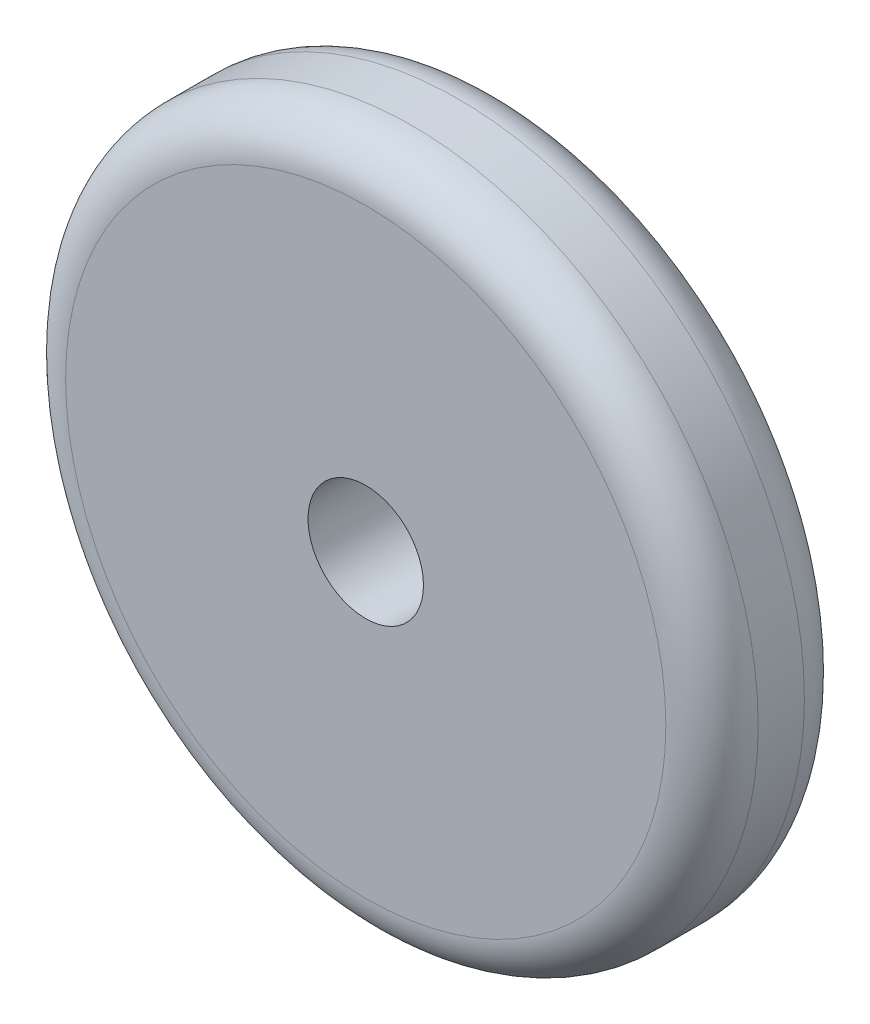
ISO-10303-21;
HEADER;
FILE_DESCRIPTION(('STEP AP214'),'2;1');
FILE_NAME('part.step','',(''),(''),'','','');
FILE_SCHEMA(('AUTOMOTIVE_DESIGN { 1 0 10303 214 1 1 1 1 }'));
ENDSEC;
DATA;
#1=APPLICATION_CONTEXT('core data for automotive mechanical design processes');
#2=APPLICATION_PROTOCOL_DEFINITION('international standard','automotive_design',2000,#1);
#3=PRODUCT_CONTEXT('',#1,'mechanical');
#4=PRODUCT('Part','Part','',(#3));
#5=PRODUCT_RELATED_PRODUCT_CATEGORY('part','',(#4));
#6=PRODUCT_DEFINITION_FORMATION('','',#4);
#7=PRODUCT_DEFINITION_CONTEXT('part definition',#1,'design');
#8=PRODUCT_DEFINITION('design','',#6,#7);
#9=PRODUCT_DEFINITION_SHAPE('','',#8);
#10=(LENGTH_UNIT() NAMED_UNIT(*) SI_UNIT(.MILLI.,.METRE.));
#11=(NAMED_UNIT(*) PLANE_ANGLE_UNIT() SI_UNIT($,.RADIAN.));
#12=(NAMED_UNIT(*) SI_UNIT($,.STERADIAN.) SOLID_ANGLE_UNIT());
#13=UNCERTAINTY_MEASURE_WITH_UNIT(LENGTH_MEASURE(1.E-05),#10,'distance_accuracy_value','');
#14=(GEOMETRIC_REPRESENTATION_CONTEXT(3) GLOBAL_UNCERTAINTY_ASSIGNED_CONTEXT((#13)) GLOBAL_UNIT_ASSIGNED_CONTEXT((#10,
#11,#12)) REPRESENTATION_CONTEXT('',''));
#15=CARTESIAN_POINT('',(0.,0.,0.));
#16=DIRECTION('',(0.,0.,1.));
#17=DIRECTION('',(1.,0.,0.));
#18=AXIS2_PLACEMENT_3D('',#15,#16,#17);
#19=CARTESIAN_POINT('',(0.,0.,6.));
#20=DIRECTION('',(0.,0.,1.));
#21=DIRECTION('',(1.,0.,0.));
#22=AXIS2_PLACEMENT_3D('',#19,#20,#21);
#23=PLANE('',#22);
#24=CARTESIAN_POINT('',(0.,0.,6.));
#25=DIRECTION('',(0.,0.,1.));
#26=DIRECTION('',(1.,0.,0.));
#27=AXIS2_PLACEMENT_3D('',#24,#25,#26);
#28=CIRCLE('',#27,13.);
#29=CARTESIAN_POINT('',(13.,0.,6.));
#30=VERTEX_POINT('',#29);
#31=EDGE_CURVE('E49',#30,#30,#28,.T.);
#32=ORIENTED_EDGE('',*,*,#31,.T.);
#33=EDGE_LOOP('',(#32));
#34=FACE_BOUND('',#33,.T.);
#35=CARTESIAN_POINT('',(0.,0.,6.));
#36=DIRECTION('',(0.,0.,1.));
#37=DIRECTION('',(1.,0.,0.));
#38=AXIS2_PLACEMENT_3D('',#35,#36,#37);
#39=CIRCLE('',#38,2.5);
#40=CARTESIAN_POINT('',(2.5,0.,6.));
#41=VERTEX_POINT('',#40);
#42=EDGE_CURVE('E54',#41,#41,#39,.T.);
#43=ORIENTED_EDGE('',*,*,#42,.F.);
#44=EDGE_LOOP('',(#43));
#45=FACE_BOUND('',#44,.T.);
#46=ADVANCED_FACE('F34',(#34,#45),#23,.T.);
#47=CARTESIAN_POINT('',(0.,0.,0.));
#48=DIRECTION('',(0.,0.,1.));
#49=DIRECTION('',(1.,0.,0.));
#50=AXIS2_PLACEMENT_3D('',#47,#48,#49);
#51=PLANE('',#50);
#52=CARTESIAN_POINT('',(0.,0.,0.));
#53=DIRECTION('',(0.,0.,1.));
#54=DIRECTION('',(1.,0.,0.));
#55=AXIS2_PLACEMENT_3D('',#52,#53,#54);
#56=CIRCLE('',#55,13.);
#57=CARTESIAN_POINT('',(13.,0.,0.));
#58=VERTEX_POINT('',#57);
#59=EDGE_CURVE('E10',#58,#58,#56,.F.);
#60=ORIENTED_EDGE('',*,*,#59,.T.);
#61=EDGE_LOOP('',(#60));
#62=FACE_BOUND('',#61,.T.);
#63=CARTESIAN_POINT('',(0.,0.,0.));
#64=DIRECTION('',(0.,0.,1.));
#65=DIRECTION('',(1.,0.,0.));
#66=AXIS2_PLACEMENT_3D('',#63,#64,#65);
#67=CIRCLE('',#66,2.5);
#68=CARTESIAN_POINT('',(2.5,0.,0.));
#69=VERTEX_POINT('',#68);
#70=EDGE_CURVE('E55',#69,#69,#67,.T.);
#71=ORIENTED_EDGE('',*,*,#70,.T.);
#72=EDGE_LOOP('',(#71));
#73=FACE_BOUND('',#72,.T.);
#74=ADVANCED_FACE('F65',(#62,#73),#51,.F.);
#75=CARTESIAN_POINT('',(0.,0.,6.));
#76=DIRECTION('',(0.,0.,-1.));
#77=DIRECTION('',(-1.,0.,0.));
#78=AXIS2_PLACEMENT_3D('',#75,#76,#77);
#79=CYLINDRICAL_SURFACE('',#78,15.);
#80=CARTESIAN_POINT('',(0.,0.,4.));
#81=DIRECTION('',(0.,0.,1.));
#82=DIRECTION('',(1.,0.,0.));
#83=AXIS2_PLACEMENT_3D('',#80,#81,#82);
#84=CIRCLE('',#83,15.);
#85=CARTESIAN_POINT('',(15.,0.,4.));
#86=VERTEX_POINT('',#85);
#87=EDGE_CURVE('E41',#86,#86,#84,.F.);
#88=ORIENTED_EDGE('',*,*,#87,.T.);
#89=EDGE_LOOP('',(#88));
#90=FACE_BOUND('',#89,.T.);
#91=CARTESIAN_POINT('',(0.,0.,2.));
#92=DIRECTION('',(0.,0.,1.));
#93=DIRECTION('',(1.,0.,0.));
#94=AXIS2_PLACEMENT_3D('',#91,#92,#93);
#95=CIRCLE('',#94,15.);
#96=CARTESIAN_POINT('',(15.,0.,2.));
#97=VERTEX_POINT('',#96);
#98=EDGE_CURVE('E45',#97,#97,#95,.T.);
#99=ORIENTED_EDGE('',*,*,#98,.T.);
#100=EDGE_LOOP('',(#99));
#101=FACE_BOUND('',#100,.T.);
#102=ADVANCED_FACE('F71',(#90,#101),#79,.T.);
#103=CARTESIAN_POINT('',(0.,0.,6.));
#104=DIRECTION('',(0.,0.,-1.));
#105=DIRECTION('',(-1.,0.,0.));
#106=AXIS2_PLACEMENT_3D('',#103,#104,#105);
#107=CYLINDRICAL_SURFACE('',#106,2.5);
#108=ORIENTED_EDGE('',*,*,#42,.T.);
#109=EDGE_LOOP('',(#108));
#110=FACE_BOUND('',#109,.T.);
#111=ORIENTED_EDGE('',*,*,#70,.F.);
#112=EDGE_LOOP('',(#111));
#113=FACE_BOUND('',#112,.T.);
#114=ADVANCED_FACE('F61',(#110,#113),#107,.F.);
#115=CARTESIAN_POINT('',(0.,0.,4.));
#116=DIRECTION('',(0.,0.,1.));
#117=DIRECTION('',(1.,0.,0.));
#118=AXIS2_PLACEMENT_3D('',#115,#116,#117);
#119=TOROIDAL_SURFACE('',#118,13.,2.);
#120=ORIENTED_EDGE('',*,*,#87,.F.);
#121=EDGE_LOOP('',(#120));
#122=FACE_BOUND('',#121,.T.);
#123=ORIENTED_EDGE('',*,*,#31,.F.);
#124=EDGE_LOOP('',(#123));
#125=FACE_BOUND('',#124,.T.);
#126=ADVANCED_FACE('F76',(#122,#125),#119,.T.);
#127=CARTESIAN_POINT('',(0.,0.,2.));
#128=DIRECTION('',(0.,0.,1.));
#129=DIRECTION('',(1.,0.,0.));
#130=AXIS2_PLACEMENT_3D('',#127,#128,#129);
#131=TOROIDAL_SURFACE('',#130,13.,2.);
#132=ORIENTED_EDGE('',*,*,#59,.F.);
#133=EDGE_LOOP('',(#132));
#134=FACE_BOUND('',#133,.T.);
#135=ORIENTED_EDGE('',*,*,#98,.F.);
#136=EDGE_LOOP('',(#135));
#137=FACE_BOUND('',#136,.T.);
#138=ADVANCED_FACE('F36',(#134,#137),#131,.T.);
#139=CLOSED_SHELL('',(#46,#74,#102,#114,#126,#138));
#140=MANIFOLD_SOLID_BREP('B2',#139);
#141=ADVANCED_BREP_SHAPE_REPRESENTATION('',(#18,#140),#14);
#142=SHAPE_DEFINITION_REPRESENTATION(#9,#141);
ENDSEC;
END-ISO-10303-21;
